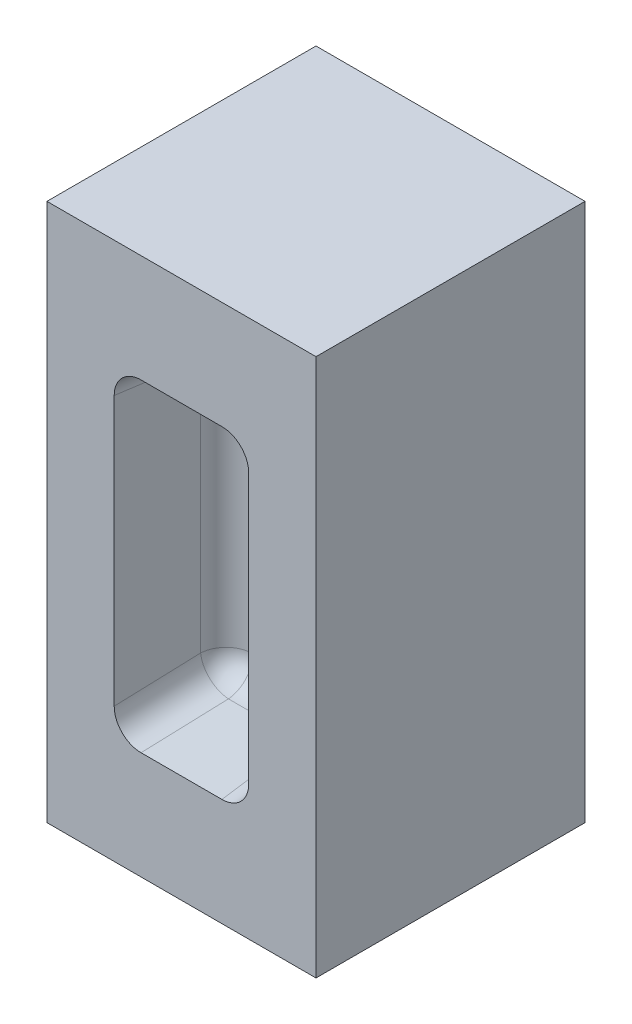
ISO-10303-21;
HEADER;
FILE_DESCRIPTION(('STEP AP214'),'2;1');
FILE_NAME('part.step','',(''),(''),'','','');
FILE_SCHEMA(('AUTOMOTIVE_DESIGN { 1 0 10303 214 1 1 1 1 }'));
ENDSEC;
DATA;
#1=APPLICATION_CONTEXT('core data for automotive mechanical design processes');
#2=APPLICATION_PROTOCOL_DEFINITION('international standard','automotive_design',2000,#1);
#3=PRODUCT_CONTEXT('',#1,'mechanical');
#4=PRODUCT('Part','Part','',(#3));
#5=PRODUCT_RELATED_PRODUCT_CATEGORY('part','',(#4));
#6=PRODUCT_DEFINITION_FORMATION('','',#4);
#7=PRODUCT_DEFINITION_CONTEXT('part definition',#1,'design');
#8=PRODUCT_DEFINITION('design','',#6,#7);
#9=PRODUCT_DEFINITION_SHAPE('','',#8);
#10=(LENGTH_UNIT() NAMED_UNIT(*) SI_UNIT(.MILLI.,.METRE.));
#11=(NAMED_UNIT(*) PLANE_ANGLE_UNIT() SI_UNIT($,.RADIAN.));
#12=(NAMED_UNIT(*) SI_UNIT($,.STERADIAN.) SOLID_ANGLE_UNIT());
#13=UNCERTAINTY_MEASURE_WITH_UNIT(LENGTH_MEASURE(1.E-05),#10,'distance_accuracy_value','');
#14=(GEOMETRIC_REPRESENTATION_CONTEXT(3) GLOBAL_UNCERTAINTY_ASSIGNED_CONTEXT((#13)) GLOBAL_UNIT_ASSIGNED_CONTEXT((#10,
#11,#12)) REPRESENTATION_CONTEXT('',''));
#15=CARTESIAN_POINT('',(0.,0.,0.));
#16=DIRECTION('',(0.,0.,1.));
#17=DIRECTION('',(1.,0.,0.));
#18=AXIS2_PLACEMENT_3D('',#15,#16,#17);
#19=CARTESIAN_POINT('',(0.,0.,50.));
#20=DIRECTION('',(1.,0.,0.));
#21=DIRECTION('',(0.,0.,-1.));
#22=AXIS2_PLACEMENT_3D('',#19,#20,#21);
#23=PLANE('',#22);
#24=DIRECTION('',(0.,-1.,0.));
#25=VECTOR('',#24,1.);
#26=CARTESIAN_POINT('',(0.,0.,0.));
#27=LINE('',#26,#25);
#28=CARTESIAN_POINT('',(0.,100.,0.));
#29=VERTEX_POINT('',#28);
#30=CARTESIAN_POINT('',(0.,0.,0.));
#31=VERTEX_POINT('',#30);
#32=EDGE_CURVE('E158',#29,#31,#27,.T.);
#33=ORIENTED_EDGE('',*,*,#32,.T.);
#34=DIRECTION('',(0.,0.,-1.));
#35=VECTOR('',#34,1.);
#36=CARTESIAN_POINT('',(0.,0.,50.));
#37=LINE('',#36,#35);
#38=CARTESIAN_POINT('',(0.,0.,50.));
#39=VERTEX_POINT('',#38);
#40=EDGE_CURVE('E139',#39,#31,#37,.T.);
#41=ORIENTED_EDGE('',*,*,#40,.F.);
#42=DIRECTION('',(0.,-1.,0.));
#43=VECTOR('',#42,1.);
#44=CARTESIAN_POINT('',(0.,0.,50.));
#45=LINE('',#44,#43);
#46=CARTESIAN_POINT('',(0.,100.,50.));
#47=VERTEX_POINT('',#46);
#48=EDGE_CURVE('E146',#47,#39,#45,.T.);
#49=ORIENTED_EDGE('',*,*,#48,.F.);
#50=DIRECTION('',(0.,0.,-1.));
#51=VECTOR('',#50,1.);
#52=CARTESIAN_POINT('',(0.,100.,50.));
#53=LINE('',#52,#51);
#54=EDGE_CURVE('E250',#47,#29,#53,.T.);
#55=ORIENTED_EDGE('',*,*,#54,.T.);
#56=EDGE_LOOP('',(#33,#41,#49,#55));
#57=FACE_BOUND('',#56,.T.);
#58=ADVANCED_FACE('F33',(#57),#23,.F.);
#59=CARTESIAN_POINT('',(0.,0.,50.));
#60=DIRECTION('',(0.,1.,0.));
#61=DIRECTION('',(0.,0.,1.));
#62=AXIS2_PLACEMENT_3D('',#59,#60,#61);
#63=PLANE('',#62);
#64=DIRECTION('',(1.,0.,0.));
#65=VECTOR('',#64,1.);
#66=CARTESIAN_POINT('',(0.,0.,0.));
#67=LINE('',#66,#65);
#68=CARTESIAN_POINT('',(50.,0.,0.));
#69=VERTEX_POINT('',#68);
#70=EDGE_CURVE('E252',#31,#69,#67,.T.);
#71=ORIENTED_EDGE('',*,*,#70,.T.);
#72=DIRECTION('',(0.,0.,-1.));
#73=VECTOR('',#72,1.);
#74=CARTESIAN_POINT('',(50.,0.,50.));
#75=LINE('',#74,#73);
#76=CARTESIAN_POINT('',(50.,0.,50.));
#77=VERTEX_POINT('',#76);
#78=EDGE_CURVE('E142',#77,#69,#75,.T.);
#79=ORIENTED_EDGE('',*,*,#78,.F.);
#80=DIRECTION('',(1.,0.,0.));
#81=VECTOR('',#80,1.);
#82=CARTESIAN_POINT('',(0.,0.,50.));
#83=LINE('',#82,#81);
#84=EDGE_CURVE('E135',#39,#77,#83,.T.);
#85=ORIENTED_EDGE('',*,*,#84,.F.);
#86=ORIENTED_EDGE('',*,*,#40,.T.);
#87=EDGE_LOOP('',(#71,#79,#85,#86));
#88=FACE_BOUND('',#87,.T.);
#89=ADVANCED_FACE('F137',(#88),#63,.F.);
#90=CARTESIAN_POINT('',(50.,0.,50.));
#91=DIRECTION('',(-1.,0.,0.));
#92=DIRECTION('',(0.,0.,1.));
#93=AXIS2_PLACEMENT_3D('',#90,#91,#92);
#94=PLANE('',#93);
#95=DIRECTION('',(0.,1.,0.));
#96=VECTOR('',#95,1.);
#97=CARTESIAN_POINT('',(50.,0.,0.));
#98=LINE('',#97,#96);
#99=CARTESIAN_POINT('',(50.,100.,0.));
#100=VERTEX_POINT('',#99);
#101=EDGE_CURVE('E254',#69,#100,#98,.T.);
#102=ORIENTED_EDGE('',*,*,#101,.T.);
#103=DIRECTION('',(0.,0.,-1.));
#104=VECTOR('',#103,1.);
#105=CARTESIAN_POINT('',(50.,100.,50.));
#106=LINE('',#105,#104);
#107=CARTESIAN_POINT('',(50.,100.,50.));
#108=VERTEX_POINT('',#107);
#109=EDGE_CURVE('E163',#108,#100,#106,.T.);
#110=ORIENTED_EDGE('',*,*,#109,.F.);
#111=DIRECTION('',(0.,1.,0.));
#112=VECTOR('',#111,1.);
#113=CARTESIAN_POINT('',(50.,0.,50.));
#114=LINE('',#113,#112);
#115=EDGE_CURVE('E145',#77,#108,#114,.T.);
#116=ORIENTED_EDGE('',*,*,#115,.F.);
#117=ORIENTED_EDGE('',*,*,#78,.T.);
#118=EDGE_LOOP('',(#102,#110,#116,#117));
#119=FACE_BOUND('',#118,.T.);
#120=ADVANCED_FACE('F266',(#119),#94,.F.);
#121=CARTESIAN_POINT('',(0.,100.,50.));
#122=DIRECTION('',(0.,-1.,0.));
#123=DIRECTION('',(0.,0.,-1.));
#124=AXIS2_PLACEMENT_3D('',#121,#122,#123);
#125=PLANE('',#124);
#126=DIRECTION('',(-1.,0.,0.));
#127=VECTOR('',#126,1.);
#128=CARTESIAN_POINT('',(0.,100.,0.));
#129=LINE('',#128,#127);
#130=EDGE_CURVE('E155',#100,#29,#129,.T.);
#131=ORIENTED_EDGE('',*,*,#130,.T.);
#132=ORIENTED_EDGE('',*,*,#54,.F.);
#133=DIRECTION('',(-1.,0.,0.));
#134=VECTOR('',#133,1.);
#135=CARTESIAN_POINT('',(0.,100.,50.));
#136=LINE('',#135,#134);
#137=EDGE_CURVE('E151',#108,#47,#136,.T.);
#138=ORIENTED_EDGE('',*,*,#137,.F.);
#139=ORIENTED_EDGE('',*,*,#109,.T.);
#140=EDGE_LOOP('',(#131,#132,#138,#139));
#141=FACE_BOUND('',#140,.T.);
#142=ADVANCED_FACE('F261',(#141),#125,.F.);
#143=CARTESIAN_POINT('',(0.,0.,50.));
#144=DIRECTION('',(0.,0.,-1.));
#145=DIRECTION('',(-1.,0.,0.));
#146=AXIS2_PLACEMENT_3D('',#143,#144,#145);
#147=PLANE('',#146);
#148=DIRECTION('',(1.,0.,0.));
#149=VECTOR('',#148,1.);
#150=CARTESIAN_POINT('',(12.5,20.,50.));
#151=LINE('',#150,#149);
#152=CARTESIAN_POINT('',(17.4840235353438,20.,50.));
#153=VERTEX_POINT('',#152);
#154=CARTESIAN_POINT('',(32.5159764646562,20.,50.));
#155=VERTEX_POINT('',#154);
#156=EDGE_CURVE('E236',#153,#155,#151,.T.);
#157=ORIENTED_EDGE('',*,*,#156,.F.);
#158=CARTESIAN_POINT('',(17.5068617299896,25.0190991877167,50.));
#159=DIRECTION('',(0.,0.,-1.));
#160=DIRECTION('',(0.5138797648823,0.857862219266306,0.));
#161=AXIS2_PLACEMENT_3D('',#158,#159,#160);
#162=ELLIPSE('',#161,5.02593484233265,5.);
#163=CARTESIAN_POINT('',(12.5,24.9962051733865,50.));
#164=VERTEX_POINT('',#163);
#165=EDGE_CURVE('E196',#153,#164,#162,.T.);
#166=ORIENTED_EDGE('',*,*,#165,.T.);
#167=DIRECTION('',(0.,-1.,0.));
#168=VECTOR('',#167,1.);
#169=CARTESIAN_POINT('',(12.5,80.,50.));
#170=LINE('',#169,#168);
#171=CARTESIAN_POINT('',(12.5,75.0037948266135,50.));
#172=VERTEX_POINT('',#171);
#173=EDGE_CURVE('E234',#172,#164,#170,.T.);
#174=ORIENTED_EDGE('',*,*,#173,.F.);
#175=CARTESIAN_POINT('',(17.5068617299896,74.9809008122833,50.));
#176=DIRECTION('',(0.,0.,-1.));
#177=DIRECTION('',(0.5138797648823,-0.857862219266306,0.));
#178=AXIS2_PLACEMENT_3D('',#175,#176,#177);
#179=ELLIPSE('',#178,5.02593484233265,5.);
#180=CARTESIAN_POINT('',(17.4840235353438,80.,50.));
#181=VERTEX_POINT('',#180);
#182=EDGE_CURVE('E11',#172,#181,#179,.T.);
#183=ORIENTED_EDGE('',*,*,#182,.T.);
#184=DIRECTION('',(-1.,0.,0.));
#185=VECTOR('',#184,1.);
#186=CARTESIAN_POINT('',(12.5,80.,50.));
#187=LINE('',#186,#185);
#188=CARTESIAN_POINT('',(32.5159764646562,80.,50.));
#189=VERTEX_POINT('',#188);
#190=EDGE_CURVE('E245',#189,#181,#187,.T.);
#191=ORIENTED_EDGE('',*,*,#190,.F.);
#192=CARTESIAN_POINT('',(32.4931382700104,74.9809008122833,50.));
#193=DIRECTION('',(0.,0.,-1.));
#194=DIRECTION('',(-0.5138797648823,-0.857862219266306,0.));
#195=AXIS2_PLACEMENT_3D('',#192,#193,#194);
#196=ELLIPSE('',#195,5.02593484233265,5.);
#197=CARTESIAN_POINT('',(37.5,75.0037948266135,50.));
#198=VERTEX_POINT('',#197);
#199=EDGE_CURVE('E42',#189,#198,#196,.T.);
#200=ORIENTED_EDGE('',*,*,#199,.T.);
#201=DIRECTION('',(0.,1.,0.));
#202=VECTOR('',#201,1.);
#203=CARTESIAN_POINT('',(37.5,80.,50.));
#204=LINE('',#203,#202);
#205=CARTESIAN_POINT('',(37.5,24.9962051733865,50.));
#206=VERTEX_POINT('',#205);
#207=EDGE_CURVE('E240',#206,#198,#204,.T.);
#208=ORIENTED_EDGE('',*,*,#207,.F.);
#209=CARTESIAN_POINT('',(32.4931382700104,25.0190991877168,50.));
#210=DIRECTION('',(0.,0.,-1.));
#211=DIRECTION('',(-0.5138797648823,0.857862219266306,0.));
#212=AXIS2_PLACEMENT_3D('',#209,#210,#211);
#213=ELLIPSE('',#212,5.02593484233265,5.);
#214=EDGE_CURVE('E198',#206,#155,#213,.T.);
#215=ORIENTED_EDGE('',*,*,#214,.T.);
#216=EDGE_LOOP('',(#157,#166,#174,#183,#191,#200,#208,#215));
#217=FACE_BOUND('',#216,.T.);
#218=ORIENTED_EDGE('',*,*,#48,.T.);
#219=ORIENTED_EDGE('',*,*,#84,.T.);
#220=ORIENTED_EDGE('',*,*,#115,.T.);
#221=ORIENTED_EDGE('',*,*,#137,.T.);
#222=EDGE_LOOP('',(#218,#219,#220,#221));
#223=FACE_BOUND('',#222,.T.);
#224=ADVANCED_FACE('F149',(#217,#223),#147,.F.);
#225=CARTESIAN_POINT('',(0.,0.,0.));
#226=DIRECTION('',(0.,0.,-1.));
#227=DIRECTION('',(-1.,0.,0.));
#228=AXIS2_PLACEMENT_3D('',#225,#226,#227);
#229=PLANE('',#228);
#230=ORIENTED_EDGE('',*,*,#32,.F.);
#231=ORIENTED_EDGE('',*,*,#130,.F.);
#232=ORIENTED_EDGE('',*,*,#101,.F.);
#233=ORIENTED_EDGE('',*,*,#70,.F.);
#234=EDGE_LOOP('',(#230,#231,#232,#233));
#235=FACE_BOUND('',#234,.T.);
#236=ADVANCED_FACE('F265',(#235),#229,.T.);
#237=CARTESIAN_POINT('',(12.5,80.,50.));
#238=DIRECTION('',(0.998629534754574,0.,0.0523359562429439));
#239=DIRECTION('',(0.052335956242944,0.,-0.998629534754574));
#240=AXIS2_PLACEMENT_3D('',#237,#238,#239);
#241=PLANE('',#240);
#242=ORIENTED_EDGE('',*,*,#173,.T.);
#243=DIRECTION('',(0.0521373445210819,0.0870372042918475,-0.994839797341939));
#244=VECTOR('',#243,1.);
#245=CARTESIAN_POINT('',(13.5254833626301,26.7081298168642,30.4326117866644));
#246=LINE('',#245,#244);
#247=CARTESIAN_POINT('',(13.2998307454624,26.3314291406056,34.7383202187853));
#248=VERTEX_POINT('',#247);
#249=EDGE_CURVE('E50',#164,#248,#246,.T.);
#250=ORIENTED_EDGE('',*,*,#249,.T.);
#251=DIRECTION('',(0.,-1.,0.));
#252=VECTOR('',#251,1.);
#253=CARTESIAN_POINT('',(13.2998307454624,80.,34.7383202187853));
#254=LINE('',#253,#252);
#255=CARTESIAN_POINT('',(13.2998307454624,73.6685708593944,34.7383202187853));
#256=VERTEX_POINT('',#255);
#257=EDGE_CURVE('E55',#248,#256,#254,.F.);
#258=ORIENTED_EDGE('',*,*,#257,.T.);
#259=DIRECTION('',(0.0521373445210819,-0.0870372042918475,-0.994839797341939));
#260=VECTOR('',#259,1.);
#261=CARTESIAN_POINT('',(12.4773277769693,75.0416434536543,50.4326117866644));
#262=LINE('',#261,#260);
#263=EDGE_CURVE('E192',#256,#172,#262,.F.);
#264=ORIENTED_EDGE('',*,*,#263,.T.);
#265=EDGE_LOOP('',(#242,#250,#258,#264));
#266=FACE_BOUND('',#265,.T.);
#267=ADVANCED_FACE('F286',(#266),#241,.T.);
#268=CARTESIAN_POINT('',(12.5,80.,50.));
#269=DIRECTION('',(0.,-0.996194698091746,0.0871557427476584));
#270=DIRECTION('',(0.,-0.0871557427476584,-0.996194698091746));
#271=AXIS2_PLACEMENT_3D('',#268,#269,#270);
#272=PLANE('',#271);
#273=DIRECTION('',(-1.,0.,0.));
#274=VECTOR('',#273,1.);
#275=CARTESIAN_POINT('',(12.5,78.6495443498531,34.5642212862617));
#276=LINE('',#275,#274);
#277=CARTESIAN_POINT('',(18.2929784192352,78.6495443498531,34.5642212862617));
#278=VERTEX_POINT('',#277);
#279=CARTESIAN_POINT('',(31.7070215807648,78.6495443498531,34.5642212862617));
#280=VERTEX_POINT('',#279);
#281=EDGE_CURVE('E175',#278,#280,#276,.F.);
#282=ORIENTED_EDGE('',*,*,#281,.T.);
#283=DIRECTION('',(-0.0521373445210819,-0.0870372042918475,-0.994839797341939));
#284=VECTOR('',#283,1.);
#285=CARTESIAN_POINT('',(32.5295245492579,80.0226169441131,50.2585128541408));
#286=LINE('',#285,#284);
#287=EDGE_CURVE('E178',#280,#189,#286,.F.);
#288=ORIENTED_EDGE('',*,*,#287,.T.);
#289=ORIENTED_EDGE('',*,*,#190,.T.);
#290=DIRECTION('',(0.0521373445210819,-0.0870372042918475,-0.994839797341939));
#291=VECTOR('',#290,1.);
#292=CARTESIAN_POINT('',(18.518631036403,78.2728436735946,30.2585128541408));
#293=LINE('',#292,#291);
#294=EDGE_CURVE('E173',#181,#278,#293,.T.);
#295=ORIENTED_EDGE('',*,*,#294,.T.);
#296=EDGE_LOOP('',(#282,#288,#289,#295));
#297=FACE_BOUND('',#296,.T.);
#298=ADVANCED_FACE('F284',(#297),#272,.T.);
#299=CARTESIAN_POINT('',(37.5,80.,50.));
#300=DIRECTION('',(-0.998629534754574,0.,0.0523359562429439));
#301=DIRECTION('',(0.052335956242944,0.,0.998629534754574));
#302=AXIS2_PLACEMENT_3D('',#299,#300,#301);
#303=PLANE('',#302);
#304=DIRECTION('',(0.,1.,0.));
#305=VECTOR('',#304,1.);
#306=CARTESIAN_POINT('',(36.7001692545377,80.,34.7383202187853));
#307=LINE('',#306,#305);
#308=CARTESIAN_POINT('',(36.7001692545377,73.6685708593944,34.7383202187853));
#309=VERTEX_POINT('',#308);
#310=CARTESIAN_POINT('',(36.7001692545377,26.3314291406056,34.7383202187853));
#311=VERTEX_POINT('',#310);
#312=EDGE_CURVE('E182',#309,#311,#307,.F.);
#313=ORIENTED_EDGE('',*,*,#312,.T.);
#314=DIRECTION('',(-0.0521373445210819,0.0870372042918475,-0.994839797341939));
#315=VECTOR('',#314,1.);
#316=CARTESIAN_POINT('',(37.5226722230308,24.9583565463457,50.4326117866644));
#317=LINE('',#316,#315);
#318=EDGE_CURVE('E184',#311,#206,#317,.F.);
#319=ORIENTED_EDGE('',*,*,#318,.T.);
#320=ORIENTED_EDGE('',*,*,#207,.T.);
#321=DIRECTION('',(-0.0521373445210819,-0.0870372042918475,-0.994839797341939));
#322=VECTOR('',#321,1.);
#323=CARTESIAN_POINT('',(36.4745166373699,73.2918701831358,30.4326117866644));
#324=LINE('',#323,#322);
#325=EDGE_CURVE('E180',#198,#309,#324,.T.);
#326=ORIENTED_EDGE('',*,*,#325,.T.);
#327=EDGE_LOOP('',(#313,#319,#320,#326));
#328=FACE_BOUND('',#327,.T.);
#329=ADVANCED_FACE('F280',(#328),#303,.T.);
#330=CARTESIAN_POINT('',(12.5,20.,50.));
#331=DIRECTION('',(0.,0.996194698091746,0.0871557427476584));
#332=DIRECTION('',(0.,-0.0871557427476584,0.996194698091746));
#333=AXIS2_PLACEMENT_3D('',#330,#331,#332);
#334=PLANE('',#333);
#335=DIRECTION('',(1.,0.,0.));
#336=VECTOR('',#335,1.);
#337=CARTESIAN_POINT('',(12.5,21.3504556501469,34.5642212862617));
#338=LINE('',#337,#336);
#339=CARTESIAN_POINT('',(31.7070215807648,21.3504556501469,34.5642212862617));
#340=VERTEX_POINT('',#339);
#341=CARTESIAN_POINT('',(18.2929784192352,21.3504556501469,34.5642212862617));
#342=VERTEX_POINT('',#341);
#343=EDGE_CURVE('E188',#340,#342,#338,.F.);
#344=ORIENTED_EDGE('',*,*,#343,.T.);
#345=DIRECTION('',(0.0521373445210819,0.0870372042918475,-0.994839797341939));
#346=VECTOR('',#345,1.);
#347=CARTESIAN_POINT('',(17.4704754507421,19.977383055887,50.2585128541408));
#348=LINE('',#347,#346);
#349=EDGE_CURVE('E190',#342,#153,#348,.F.);
#350=ORIENTED_EDGE('',*,*,#349,.T.);
#351=ORIENTED_EDGE('',*,*,#156,.T.);
#352=DIRECTION('',(-0.0521373445210819,0.0870372042918475,-0.994839797341939));
#353=VECTOR('',#352,1.);
#354=CARTESIAN_POINT('',(31.4813689635971,21.7271563264054,30.2585128541408));
#355=LINE('',#354,#353);
#356=EDGE_CURVE('E186',#155,#340,#355,.T.);
#357=ORIENTED_EDGE('',*,*,#356,.T.);
#358=EDGE_LOOP('',(#344,#350,#351,#357));
#359=FACE_BOUND('',#358,.T.);
#360=ADVANCED_FACE('F283',(#359),#334,.T.);
#361=CARTESIAN_POINT('',(0.,0.,30.));
#362=DIRECTION('',(0.,0.,1.));
#363=DIRECTION('',(1.,0.,0.));
#364=AXIS2_PLACEMENT_3D('',#361,#362,#363);
#365=PLANE('',#364);
#366=DIRECTION('',(0.,-1.,0.));
#367=VECTOR('',#366,1.);
#368=CARTESIAN_POINT('',(31.7070215807648,0.,30.));
#369=LINE('',#368,#367);
#370=CARTESIAN_POINT('',(31.7070215807648,26.3314291406056,30.));
#371=VERTEX_POINT('',#370);
#372=CARTESIAN_POINT('',(31.7070215807648,73.6685708593944,30.));
#373=VERTEX_POINT('',#372);
#374=EDGE_CURVE('E168',#371,#373,#369,.F.);
#375=ORIENTED_EDGE('',*,*,#374,.T.);
#376=DIRECTION('',(1.,0.,0.));
#377=VECTOR('',#376,1.);
#378=CARTESIAN_POINT('',(0.,73.6685708593944,30.));
#379=LINE('',#378,#377);
#380=CARTESIAN_POINT('',(18.2929784192352,73.6685708593944,30.));
#381=VERTEX_POINT('',#380);
#382=EDGE_CURVE('E170',#373,#381,#379,.F.);
#383=ORIENTED_EDGE('',*,*,#382,.T.);
#384=DIRECTION('',(0.,1.,0.));
#385=VECTOR('',#384,1.);
#386=CARTESIAN_POINT('',(18.2929784192352,0.,30.));
#387=LINE('',#386,#385);
#388=CARTESIAN_POINT('',(18.2929784192352,26.3314291406056,30.));
#389=VERTEX_POINT('',#388);
#390=EDGE_CURVE('E159',#381,#389,#387,.F.);
#391=ORIENTED_EDGE('',*,*,#390,.T.);
#392=DIRECTION('',(-1.,0.,0.));
#393=VECTOR('',#392,1.);
#394=CARTESIAN_POINT('',(0.,26.3314291406056,30.));
#395=LINE('',#394,#393);
#396=EDGE_CURVE('E161',#389,#371,#395,.F.);
#397=ORIENTED_EDGE('',*,*,#396,.T.);
#398=EDGE_LOOP('',(#375,#383,#391,#397));
#399=FACE_BOUND('',#398,.T.);
#400=ADVANCED_FACE('F291',(#399),#365,.T.);
#401=CARTESIAN_POINT('',(32.2572512268789,25.4128850422021,45.4990070871444));
#402=DIRECTION('',(-0.0521373445210819,0.0870372042918475,-0.994839797341938));
#403=DIRECTION('',(0.,0.996194698091746,0.0871557427476584));
#404=AXIS2_PLACEMENT_3D('',#401,#402,#403);
#405=CYLINDRICAL_SURFACE('',#404,5.);
#406=ORIENTED_EDGE('',*,*,#214,.F.);
#407=ORIENTED_EDGE('',*,*,#318,.F.);
#408=CARTESIAN_POINT('',(31.7070215807648,26.3314291406056,35.));
#409=DIRECTION('',(0.0521373445210819,-0.0870372042918468,0.994839797341939));
#410=DIRECTION('',(0.,-0.996194698091746,-0.0871557427476577));
#411=AXIS2_PLACEMENT_3D('',#408,#409,#410);
#412=CIRCLE('',#411,5.);
#413=EDGE_CURVE('E37',#340,#311,#412,.T.);
#414=ORIENTED_EDGE('',*,*,#413,.F.);
#415=ORIENTED_EDGE('',*,*,#356,.F.);
#416=EDGE_LOOP('',(#406,#407,#414,#415));
#417=FACE_BOUND('',#416,.T.);
#418=ADVANCED_FACE('F35',(#417),#405,.F.);
#419=CARTESIAN_POINT('',(0.,26.3314291406056,35.));
#420=DIRECTION('',(-1.,0.,0.));
#421=DIRECTION('',(0.,0.,1.));
#422=AXIS2_PLACEMENT_3D('',#419,#420,#421);
#423=CYLINDRICAL_SURFACE('',#422,5.);
#424=CARTESIAN_POINT('',(18.2929784192352,26.3314291406056,35.));
#425=DIRECTION('',(1.,0.,0.));
#426=DIRECTION('',(0.,0.,-1.));
#427=AXIS2_PLACEMENT_3D('',#424,#425,#426);
#428=CIRCLE('',#427,5.);
#429=EDGE_CURVE('E226',#342,#389,#428,.T.);
#430=ORIENTED_EDGE('',*,*,#429,.F.);
#431=ORIENTED_EDGE('',*,*,#343,.F.);
#432=CARTESIAN_POINT('',(31.7070215807648,26.3314291406056,35.));
#433=DIRECTION('',(-1.,0.,0.));
#434=DIRECTION('',(0.,-1.,0.));
#435=AXIS2_PLACEMENT_3D('',#432,#433,#434);
#436=CIRCLE('',#435,5.);
#437=EDGE_CURVE('E228',#371,#340,#436,.T.);
#438=ORIENTED_EDGE('',*,*,#437,.F.);
#439=ORIENTED_EDGE('',*,*,#396,.F.);
#440=EDGE_LOOP('',(#430,#431,#438,#439));
#441=FACE_BOUND('',#440,.T.);
#442=ADVANCED_FACE('F333',(#441),#423,.F.);
#443=CARTESIAN_POINT('',(17.4704754507421,24.9583565463457,50.6942915678791));
#444=DIRECTION('',(0.0521373445210819,0.0870372042918475,-0.994839797341938));
#445=DIRECTION('',(0.,0.996194698091746,0.0871557427476584));
#446=AXIS2_PLACEMENT_3D('',#443,#444,#445);
#447=CYLINDRICAL_SURFACE('',#446,5.);
#448=ORIENTED_EDGE('',*,*,#165,.F.);
#449=ORIENTED_EDGE('',*,*,#349,.F.);
#450=CARTESIAN_POINT('',(18.2929784192352,26.3314291406056,35.));
#451=DIRECTION('',(-0.0521373445210816,-0.0870372042918468,0.994839797341939));
#452=DIRECTION('',(0.,-0.996194698091746,-0.0871557427476577));
#453=AXIS2_PLACEMENT_3D('',#450,#451,#452);
#454=CIRCLE('',#453,5.);
#455=EDGE_CURVE('E223',#248,#342,#454,.T.);
#456=ORIENTED_EDGE('',*,*,#455,.F.);
#457=ORIENTED_EDGE('',*,*,#249,.F.);
#458=EDGE_LOOP('',(#448,#449,#456,#457));
#459=FACE_BOUND('',#458,.T.);
#460=ADVANCED_FACE('F331',(#459),#447,.F.);
#461=CARTESIAN_POINT('',(31.7070215807648,26.3314291406056,35.));
#462=DIRECTION('',(0.,0.,1.));
#463=DIRECTION('',(1.,0.,0.));
#464=AXIS2_PLACEMENT_3D('',#461,#462,#463);
#465=SPHERICAL_SURFACE('',#464,5.);
#466=ORIENTED_EDGE('',*,*,#437,.T.);
#467=ORIENTED_EDGE('',*,*,#413,.T.);
#468=CARTESIAN_POINT('',(31.7070215807648,26.3314291406056,35.));
#469=DIRECTION('',(0.,1.,0.));
#470=DIRECTION('',(0.,0.,1.));
#471=AXIS2_PLACEMENT_3D('',#468,#469,#470);
#472=CIRCLE('',#471,5.);
#473=EDGE_CURVE('E220',#371,#311,#472,.F.);
#474=ORIENTED_EDGE('',*,*,#473,.F.);
#475=EDGE_LOOP('',(#466,#467,#474));
#476=FACE_BOUND('',#475,.T.);
#477=ADVANCED_FACE('F327',(#476),#465,.F.);
#478=CARTESIAN_POINT('',(18.2929784192352,26.3314291406056,35.));
#479=DIRECTION('',(0.,0.,1.));
#480=DIRECTION('',(1.,0.,0.));
#481=AXIS2_PLACEMENT_3D('',#478,#479,#480);
#482=SPHERICAL_SURFACE('',#481,5.);
#483=ORIENTED_EDGE('',*,*,#455,.T.);
#484=ORIENTED_EDGE('',*,*,#429,.T.);
#485=CARTESIAN_POINT('',(18.2929784192352,26.3314291406056,35.));
#486=DIRECTION('',(0.,1.,0.));
#487=DIRECTION('',(0.,0.,1.));
#488=AXIS2_PLACEMENT_3D('',#485,#486,#487);
#489=CIRCLE('',#488,5.);
#490=EDGE_CURVE('E217',#248,#389,#489,.F.);
#491=ORIENTED_EDGE('',*,*,#490,.F.);
#492=EDGE_LOOP('',(#483,#484,#491));
#493=FACE_BOUND('',#492,.T.);
#494=ADVANCED_FACE('F323',(#493),#482,.F.);
#495=CARTESIAN_POINT('',(32.4615669819151,74.9281962359964,49.3975839364466));
#496=DIRECTION('',(-0.0521373445210819,-0.0870372042918475,-0.994839797341938));
#497=DIRECTION('',(0.,0.996194698091746,-0.0871557427476584));
#498=AXIS2_PLACEMENT_3D('',#495,#496,#497);
#499=CYLINDRICAL_SURFACE('',#498,5.);
#500=ORIENTED_EDGE('',*,*,#199,.F.);
#501=ORIENTED_EDGE('',*,*,#287,.F.);
#502=CARTESIAN_POINT('',(31.7070215807648,73.6685708593944,35.));
#503=DIRECTION('',(0.0521373445210817,0.0870372042918466,0.994839797341939));
#504=DIRECTION('',(0.,-0.996194698091746,0.0871557427476574));
#505=AXIS2_PLACEMENT_3D('',#502,#503,#504);
#506=CIRCLE('',#505,5.);
#507=EDGE_CURVE('E214',#309,#280,#506,.T.);
#508=ORIENTED_EDGE('',*,*,#507,.F.);
#509=ORIENTED_EDGE('',*,*,#325,.F.);
#510=EDGE_LOOP('',(#500,#501,#508,#509));
#511=FACE_BOUND('',#510,.T.);
#512=ADVANCED_FACE('F319',(#511),#499,.F.);
#513=CARTESIAN_POINT('',(31.7070215807648,0.,35.));
#514=DIRECTION('',(0.,-1.,0.));
#515=DIRECTION('',(0.,0.,-1.));
#516=AXIS2_PLACEMENT_3D('',#513,#514,#515);
#517=CYLINDRICAL_SURFACE('',#516,5.);
#518=ORIENTED_EDGE('',*,*,#473,.T.);
#519=ORIENTED_EDGE('',*,*,#312,.F.);
#520=CARTESIAN_POINT('',(31.7070215807648,73.6685708593944,35.));
#521=DIRECTION('',(0.,-1.,0.));
#522=DIRECTION('',(1.,0.,0.));
#523=AXIS2_PLACEMENT_3D('',#520,#521,#522);
#524=CIRCLE('',#523,5.);
#525=EDGE_CURVE('E211',#373,#309,#524,.T.);
#526=ORIENTED_EDGE('',*,*,#525,.F.);
#527=ORIENTED_EDGE('',*,*,#374,.F.);
#528=EDGE_LOOP('',(#518,#519,#526,#527));
#529=FACE_BOUND('',#528,.T.);
#530=ADVANCED_FACE('F315',(#529),#517,.F.);
#531=CARTESIAN_POINT('',(18.2929784192352,0.,35.));
#532=DIRECTION('',(0.,1.,0.));
#533=DIRECTION('',(0.,0.,1.));
#534=AXIS2_PLACEMENT_3D('',#531,#532,#533);
#535=CYLINDRICAL_SURFACE('',#534,5.);
#536=ORIENTED_EDGE('',*,*,#490,.T.);
#537=ORIENTED_EDGE('',*,*,#390,.F.);
#538=CARTESIAN_POINT('',(18.2929784192352,73.6685708593944,35.));
#539=DIRECTION('',(0.,-1.,0.));
#540=DIRECTION('',(0.,0.,-1.));
#541=AXIS2_PLACEMENT_3D('',#538,#539,#540);
#542=CIRCLE('',#541,5.);
#543=EDGE_CURVE('E208',#256,#381,#542,.T.);
#544=ORIENTED_EDGE('',*,*,#543,.F.);
#545=ORIENTED_EDGE('',*,*,#257,.F.);
#546=EDGE_LOOP('',(#536,#537,#544,#545));
#547=FACE_BOUND('',#546,.T.);
#548=ADVANCED_FACE('F311',(#547),#535,.F.);
#549=CARTESIAN_POINT('',(17.4704754507421,75.0416434536543,50.6942915678791));
#550=DIRECTION('',(0.0521373445210819,-0.0870372042918475,-0.994839797341938));
#551=DIRECTION('',(0.,0.996194698091746,-0.0871557427476584));
#552=AXIS2_PLACEMENT_3D('',#549,#550,#551);
#553=CYLINDRICAL_SURFACE('',#552,5.);
#554=ORIENTED_EDGE('',*,*,#182,.F.);
#555=ORIENTED_EDGE('',*,*,#263,.F.);
#556=CARTESIAN_POINT('',(18.2929784192352,73.6685708593944,35.));
#557=DIRECTION('',(-0.0521373445210816,0.0870372042918468,0.994839797341939));
#558=DIRECTION('',(0.,-0.996194698091746,0.0871557427476577));
#559=AXIS2_PLACEMENT_3D('',#556,#557,#558);
#560=CIRCLE('',#559,5.);
#561=EDGE_CURVE('E205',#278,#256,#560,.T.);
#562=ORIENTED_EDGE('',*,*,#561,.F.);
#563=ORIENTED_EDGE('',*,*,#294,.F.);
#564=EDGE_LOOP('',(#554,#555,#562,#563));
#565=FACE_BOUND('',#564,.T.);
#566=ADVANCED_FACE('F307',(#565),#553,.F.);
#567=CARTESIAN_POINT('',(31.7070215807648,73.6685708593944,35.));
#568=DIRECTION('',(0.,0.,1.));
#569=DIRECTION('',(1.,0.,0.));
#570=AXIS2_PLACEMENT_3D('',#567,#568,#569);
#571=SPHERICAL_SURFACE('',#570,5.);
#572=ORIENTED_EDGE('',*,*,#525,.T.);
#573=ORIENTED_EDGE('',*,*,#507,.T.);
#574=CARTESIAN_POINT('',(31.7070215807648,73.6685708593944,35.));
#575=DIRECTION('',(-1.,0.,0.));
#576=DIRECTION('',(0.,0.,1.));
#577=AXIS2_PLACEMENT_3D('',#574,#575,#576);
#578=CIRCLE('',#577,5.);
#579=EDGE_CURVE('E203',#373,#280,#578,.F.);
#580=ORIENTED_EDGE('',*,*,#579,.F.);
#581=EDGE_LOOP('',(#572,#573,#580));
#582=FACE_BOUND('',#581,.T.);
#583=ADVANCED_FACE('F303',(#582),#571,.F.);
#584=CARTESIAN_POINT('',(18.2929784192352,73.6685708593944,35.));
#585=DIRECTION('',(0.,0.,1.));
#586=DIRECTION('',(1.,0.,0.));
#587=AXIS2_PLACEMENT_3D('',#584,#585,#586);
#588=SPHERICAL_SURFACE('',#587,5.);
#589=ORIENTED_EDGE('',*,*,#561,.T.);
#590=ORIENTED_EDGE('',*,*,#543,.T.);
#591=CARTESIAN_POINT('',(18.2929784192352,73.6685708593944,35.));
#592=DIRECTION('',(1.,0.,0.));
#593=DIRECTION('',(0.,1.,0.));
#594=AXIS2_PLACEMENT_3D('',#591,#592,#593);
#595=CIRCLE('',#594,5.);
#596=EDGE_CURVE('E201',#278,#381,#595,.F.);
#597=ORIENTED_EDGE('',*,*,#596,.F.);
#598=EDGE_LOOP('',(#589,#590,#597));
#599=FACE_BOUND('',#598,.T.);
#600=ADVANCED_FACE('F299',(#599),#588,.F.);
#601=CARTESIAN_POINT('',(0.,73.6685708593944,35.));
#602=DIRECTION('',(1.,0.,0.));
#603=DIRECTION('',(0.,0.,-1.));
#604=AXIS2_PLACEMENT_3D('',#601,#602,#603);
#605=CYLINDRICAL_SURFACE('',#604,5.);
#606=ORIENTED_EDGE('',*,*,#579,.T.);
#607=ORIENTED_EDGE('',*,*,#281,.F.);
#608=ORIENTED_EDGE('',*,*,#596,.T.);
#609=ORIENTED_EDGE('',*,*,#382,.F.);
#610=EDGE_LOOP('',(#606,#607,#608,#609));
#611=FACE_BOUND('',#610,.T.);
#612=ADVANCED_FACE('F296',(#611),#605,.F.);
#613=CLOSED_SHELL('',(#58,#89,#120,#142,#224,#236,#267,#298,#329,#360,#400,#418,#442,#460,#477,
#494,#512,#530,#548,#566,#583,#600,#612));
#614=MANIFOLD_SOLID_BREP('B2',#613);
#615=ADVANCED_BREP_SHAPE_REPRESENTATION('',(#18,#614),#14);
#616=SHAPE_DEFINITION_REPRESENTATION(#9,#615);
ENDSEC;
END-ISO-10303-21;
